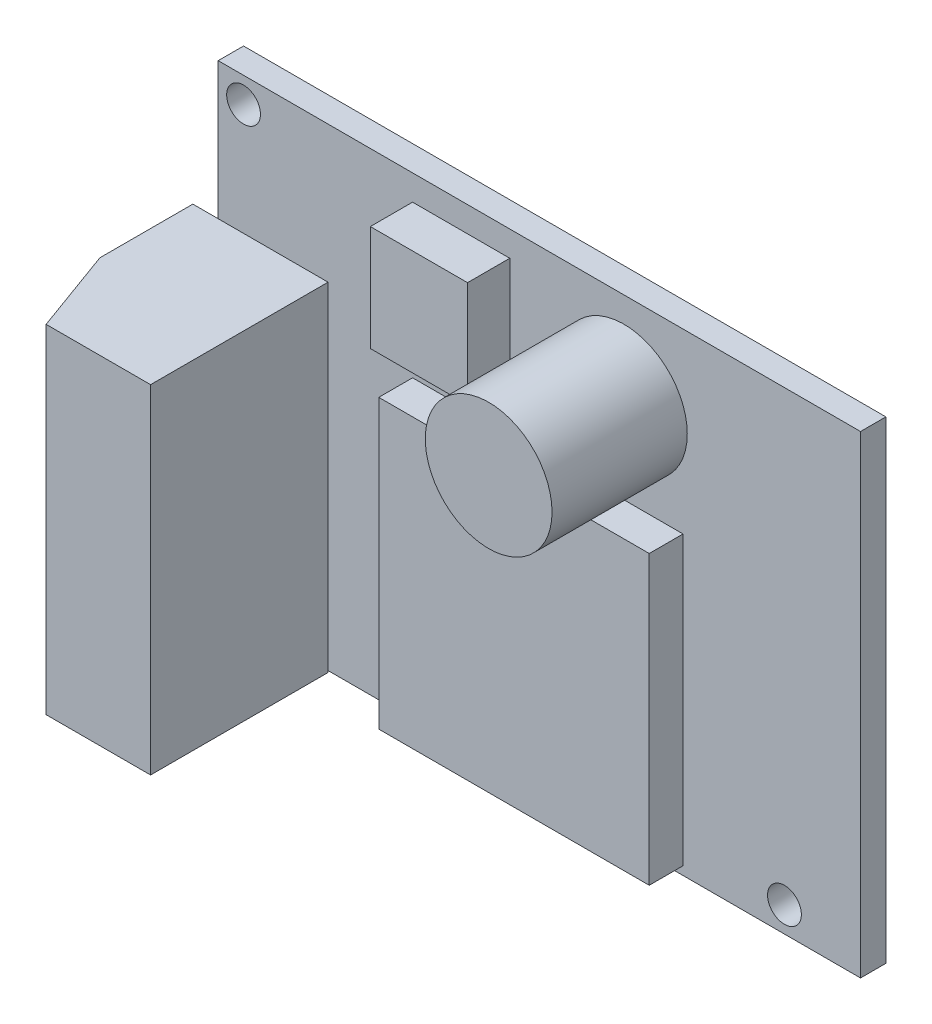
ISO-10303-21;
HEADER;
FILE_DESCRIPTION(('STEP AP214'),'2;1');
FILE_NAME('part.step','',(''),(''),'','','');
FILE_SCHEMA(('AUTOMOTIVE_DESIGN { 1 0 10303 214 1 1 1 1 }'));
ENDSEC;
DATA;
#1=APPLICATION_CONTEXT('core data for automotive mechanical design processes');
#2=APPLICATION_PROTOCOL_DEFINITION('international standard','automotive_design',2000,#1);
#3=PRODUCT_CONTEXT('',#1,'mechanical');
#4=PRODUCT('Part','Part','',(#3));
#5=PRODUCT_RELATED_PRODUCT_CATEGORY('part','',(#4));
#6=PRODUCT_DEFINITION_FORMATION('','',#4);
#7=PRODUCT_DEFINITION_CONTEXT('part definition',#1,'design');
#8=PRODUCT_DEFINITION('design','',#6,#7);
#9=PRODUCT_DEFINITION_SHAPE('','',#8);
#10=(LENGTH_UNIT() NAMED_UNIT(*) SI_UNIT(.MILLI.,.METRE.));
#11=(NAMED_UNIT(*) PLANE_ANGLE_UNIT() SI_UNIT($,.RADIAN.));
#12=(NAMED_UNIT(*) SI_UNIT($,.STERADIAN.) SOLID_ANGLE_UNIT());
#13=UNCERTAINTY_MEASURE_WITH_UNIT(LENGTH_MEASURE(1.E-05),#10,'distance_accuracy_value','');
#14=(GEOMETRIC_REPRESENTATION_CONTEXT(3) GLOBAL_UNCERTAINTY_ASSIGNED_CONTEXT((#13)) GLOBAL_UNIT_ASSIGNED_CONTEXT((#10,
#11,#12)) REPRESENTATION_CONTEXT('',''));
#15=CARTESIAN_POINT('',(0.,0.,0.));
#16=DIRECTION('',(0.,0.,1.));
#17=DIRECTION('',(1.,0.,0.));
#18=AXIS2_PLACEMENT_3D('',#15,#16,#17);
#19=CARTESIAN_POINT('',(0.,0.,1.5));
#20=DIRECTION('',(0.,0.,1.));
#21=DIRECTION('',(1.,0.,0.));
#22=AXIS2_PLACEMENT_3D('',#19,#20,#21);
#23=PLANE('',#22);
#24=DIRECTION('',(0.,1.,0.));
#25=VECTOR('',#24,1.);
#26=CARTESIAN_POINT('',(8.5,3.50000000000001,1.5));
#27=LINE('',#26,#25);
#28=CARTESIAN_POINT('',(8.5,-13.5,1.5));
#29=VERTEX_POINT('',#28);
#30=CARTESIAN_POINT('',(8.5,3.50000000000001,1.5));
#31=VERTEX_POINT('',#30);
#32=EDGE_CURVE('E216',#29,#31,#27,.T.);
#33=ORIENTED_EDGE('',*,*,#32,.F.);
#34=DIRECTION('',(1.,0.,0.));
#35=VECTOR('',#34,1.);
#36=CARTESIAN_POINT('',(8.5,-13.5,1.5));
#37=LINE('',#36,#35);
#38=CARTESIAN_POINT('',(-7.5,-13.5,1.5));
#39=VERTEX_POINT('',#38);
#40=EDGE_CURVE('E213',#39,#29,#37,.T.);
#41=ORIENTED_EDGE('',*,*,#40,.F.);
#42=DIRECTION('',(0.,-1.,0.));
#43=VECTOR('',#42,1.);
#44=CARTESIAN_POINT('',(-7.5,-13.5,1.5));
#45=LINE('',#44,#43);
#46=CARTESIAN_POINT('',(-7.5,3.50000000000001,1.5));
#47=VERTEX_POINT('',#46);
#48=EDGE_CURVE('E206',#47,#39,#45,.T.);
#49=ORIENTED_EDGE('',*,*,#48,.F.);
#50=DIRECTION('',(-1.,0.,0.));
#51=VECTOR('',#50,1.);
#52=CARTESIAN_POINT('',(-7.5,3.50000000000001,1.5));
#53=LINE('',#52,#51);
#54=EDGE_CURVE('E218',#31,#47,#53,.T.);
#55=ORIENTED_EDGE('',*,*,#54,.F.);
#56=EDGE_LOOP('',(#33,#41,#49,#55));
#57=FACE_BOUND('',#56,.T.);
#58=CARTESIAN_POINT('',(5.,8.75,1.5));
#59=DIRECTION('',(0.,0.,1.));
#60=DIRECTION('',(1.,0.,0.));
#61=AXIS2_PLACEMENT_3D('',#58,#59,#60);
#62=CIRCLE('',#61,3.75);
#63=CARTESIAN_POINT('',(8.75,8.75,1.5));
#64=VERTEX_POINT('',#63);
#65=EDGE_CURVE('E260',#64,#64,#62,.T.);
#66=ORIENTED_EDGE('',*,*,#65,.F.);
#67=EDGE_LOOP('',(#66));
#68=FACE_BOUND('',#67,.T.);
#69=DIRECTION('',(1.,0.,0.));
#70=VECTOR('',#69,1.);
#71=CARTESIAN_POINT('',(-1.75,6.25,1.5));
#72=LINE('',#71,#70);
#73=CARTESIAN_POINT('',(-7.5,6.25,1.5));
#74=VERTEX_POINT('',#73);
#75=CARTESIAN_POINT('',(-1.75,6.25,1.5));
#76=VERTEX_POINT('',#75);
#77=EDGE_CURVE('E245',#74,#76,#72,.T.);
#78=ORIENTED_EDGE('',*,*,#77,.F.);
#79=DIRECTION('',(0.,-1.,0.));
#80=VECTOR('',#79,1.);
#81=CARTESIAN_POINT('',(-7.5,12.5,1.5));
#82=LINE('',#81,#80);
#83=CARTESIAN_POINT('',(-7.5,12.5,1.5));
#84=VERTEX_POINT('',#83);
#85=EDGE_CURVE('E231',#84,#74,#82,.T.);
#86=ORIENTED_EDGE('',*,*,#85,.F.);
#87=DIRECTION('',(-1.,0.,0.));
#88=VECTOR('',#87,1.);
#89=CARTESIAN_POINT('',(-7.5,12.5,1.5));
#90=LINE('',#89,#88);
#91=CARTESIAN_POINT('',(-1.75,12.5,1.5));
#92=VERTEX_POINT('',#91);
#93=EDGE_CURVE('E236',#92,#84,#90,.T.);
#94=ORIENTED_EDGE('',*,*,#93,.F.);
#95=DIRECTION('',(0.,1.,0.));
#96=VECTOR('',#95,1.);
#97=CARTESIAN_POINT('',(-1.75,12.5,1.5));
#98=LINE('',#97,#96);
#99=EDGE_CURVE('E247',#76,#92,#98,.T.);
#100=ORIENTED_EDGE('',*,*,#99,.F.);
#101=EDGE_LOOP('',(#78,#86,#94,#100));
#102=FACE_BOUND('',#101,.T.);
#103=CARTESIAN_POINT('',(14.5,-12.5,1.5));
#104=DIRECTION('',(0.,0.,1.));
#105=DIRECTION('',(1.,0.,0.));
#106=AXIS2_PLACEMENT_3D('',#103,#104,#105);
#107=CIRCLE('',#106,1.);
#108=CARTESIAN_POINT('',(15.5,-12.5,1.5));
#109=VERTEX_POINT('',#108);
#110=EDGE_CURVE('E198',#109,#109,#107,.T.);
#111=ORIENTED_EDGE('',*,*,#110,.F.);
#112=EDGE_LOOP('',(#111));
#113=FACE_BOUND('',#112,.T.);
#114=CARTESIAN_POINT('',(-17.5,12.5,1.5));
#115=DIRECTION('',(0.,0.,1.));
#116=DIRECTION('',(1.,0.,0.));
#117=AXIS2_PLACEMENT_3D('',#114,#115,#116);
#118=CIRCLE('',#117,1.);
#119=CARTESIAN_POINT('',(-16.5,12.5,1.5));
#120=VERTEX_POINT('',#119);
#121=EDGE_CURVE('E189',#120,#120,#118,.T.);
#122=ORIENTED_EDGE('',*,*,#121,.F.);
#123=EDGE_LOOP('',(#122));
#124=FACE_BOUND('',#123,.T.);
#125=DIRECTION('',(-1.,0.,0.));
#126=VECTOR('',#125,1.);
#127=CARTESIAN_POINT('',(-12.5,5.9,1.5));
#128=LINE('',#127,#126);
#129=CARTESIAN_POINT('',(-12.5,5.9,1.5));
#130=VERTEX_POINT('',#129);
#131=CARTESIAN_POINT('',(-19.,5.90000000000001,1.5));
#132=VERTEX_POINT('',#131);
#133=EDGE_CURVE('E313',#130,#132,#128,.T.);
#134=ORIENTED_EDGE('',*,*,#133,.F.);
#135=DIRECTION('',(0.,1.,0.));
#136=VECTOR('',#135,1.);
#137=CARTESIAN_POINT('',(-12.5,5.9,1.5));
#138=LINE('',#137,#136);
#139=CARTESIAN_POINT('',(-12.5,-14.,1.5));
#140=VERTEX_POINT('',#139);
#141=EDGE_CURVE('E185',#140,#130,#138,.T.);
#142=ORIENTED_EDGE('',*,*,#141,.F.);
#143=DIRECTION('',(1.,0.,0.));
#144=VECTOR('',#143,1.);
#145=CARTESIAN_POINT('',(-19.,-14.,1.5));
#146=LINE('',#145,#144);
#147=CARTESIAN_POINT('',(19.,-14.,1.5));
#148=VERTEX_POINT('',#147);
#149=EDGE_CURVE('E270',#140,#148,#146,.T.);
#150=ORIENTED_EDGE('',*,*,#149,.T.);
#151=DIRECTION('',(0.,1.,0.));
#152=VECTOR('',#151,1.);
#153=CARTESIAN_POINT('',(19.,14.,1.5));
#154=LINE('',#153,#152);
#155=CARTESIAN_POINT('',(19.,14.,1.5));
#156=VERTEX_POINT('',#155);
#157=EDGE_CURVE('E275',#148,#156,#154,.T.);
#158=ORIENTED_EDGE('',*,*,#157,.T.);
#159=DIRECTION('',(-1.,0.,0.));
#160=VECTOR('',#159,1.);
#161=CARTESIAN_POINT('',(-19.,14.,1.5));
#162=LINE('',#161,#160);
#163=CARTESIAN_POINT('',(-19.,14.,1.5));
#164=VERTEX_POINT('',#163);
#165=EDGE_CURVE('E277',#156,#164,#162,.T.);
#166=ORIENTED_EDGE('',*,*,#165,.T.);
#167=DIRECTION('',(0.,-1.,0.));
#168=VECTOR('',#167,1.);
#169=CARTESIAN_POINT('',(-19.,14.,1.5));
#170=LINE('',#169,#168);
#171=EDGE_CURVE('E267',#164,#132,#170,.T.);
#172=ORIENTED_EDGE('',*,*,#171,.T.);
#173=EDGE_LOOP('',(#134,#142,#150,#158,#166,#172));
#174=FACE_BOUND('',#173,.T.);
#175=ADVANCED_FACE('F38',(#57,#68,#102,#113,#124,#174),#23,.T.);
#176=CARTESIAN_POINT('',(-19.,14.,1.5));
#177=DIRECTION('',(1.,0.,0.));
#178=DIRECTION('',(0.,1.,0.));
#179=AXIS2_PLACEMENT_3D('',#176,#177,#178);
#180=PLANE('',#179);
#181=DIRECTION('',(0.,-1.,0.));
#182=VECTOR('',#181,1.);
#183=CARTESIAN_POINT('',(-19.,14.,0.));
#184=LINE('',#183,#182);
#185=CARTESIAN_POINT('',(-19.,14.,0.));
#186=VERTEX_POINT('',#185);
#187=CARTESIAN_POINT('',(-19.,-14.,0.));
#188=VERTEX_POINT('',#187);
#189=EDGE_CURVE('E264',#186,#188,#184,.T.);
#190=ORIENTED_EDGE('',*,*,#189,.T.);
#191=DIRECTION('',(0.,0.,-1.));
#192=VECTOR('',#191,1.);
#193=CARTESIAN_POINT('',(-19.,-14.,1.5));
#194=LINE('',#193,#192);
#195=CARTESIAN_POINT('',(-19.,-14.,1.5));
#196=VERTEX_POINT('',#195);
#197=EDGE_CURVE('E295',#196,#188,#194,.T.);
#198=ORIENTED_EDGE('',*,*,#197,.F.);
#199=DIRECTION('',(0.,1.,0.));
#200=VECTOR('',#199,1.);
#201=CARTESIAN_POINT('',(-19.,14.,1.5));
#202=LINE('',#201,#200);
#203=EDGE_CURVE('E186',#196,#132,#202,.T.);
#204=ORIENTED_EDGE('',*,*,#203,.T.);
#205=ORIENTED_EDGE('',*,*,#171,.F.);
#206=DIRECTION('',(0.,0.,-1.));
#207=VECTOR('',#206,1.);
#208=CARTESIAN_POINT('',(-19.,14.,1.5));
#209=LINE('',#208,#207);
#210=EDGE_CURVE('E279',#164,#186,#209,.T.);
#211=ORIENTED_EDGE('',*,*,#210,.T.);
#212=EDGE_LOOP('',(#190,#198,#204,#205,#211));
#213=FACE_BOUND('',#212,.T.);
#214=ADVANCED_FACE('F332',(#213),#180,.F.);
#215=CARTESIAN_POINT('',(-19.,-14.,1.5));
#216=DIRECTION('',(0.,1.,0.));
#217=DIRECTION('',(0.,0.,1.));
#218=AXIS2_PLACEMENT_3D('',#215,#216,#217);
#219=PLANE('',#218);
#220=DIRECTION('',(1.,0.,0.));
#221=VECTOR('',#220,1.);
#222=CARTESIAN_POINT('',(-19.,-14.,0.));
#223=LINE('',#222,#221);
#224=CARTESIAN_POINT('',(19.,-14.,0.));
#225=VERTEX_POINT('',#224);
#226=EDGE_CURVE('E282',#188,#225,#223,.T.);
#227=ORIENTED_EDGE('',*,*,#226,.T.);
#228=DIRECTION('',(0.,0.,-1.));
#229=VECTOR('',#228,1.);
#230=CARTESIAN_POINT('',(19.,-14.,1.5));
#231=LINE('',#230,#229);
#232=EDGE_CURVE('E292',#148,#225,#231,.T.);
#233=ORIENTED_EDGE('',*,*,#232,.F.);
#234=ORIENTED_EDGE('',*,*,#149,.F.);
#235=EDGE_CURVE('E272',#196,#140,#146,.T.);
#236=ORIENTED_EDGE('',*,*,#235,.F.);
#237=ORIENTED_EDGE('',*,*,#197,.T.);
#238=EDGE_LOOP('',(#227,#233,#234,#236,#237));
#239=FACE_BOUND('',#238,.T.);
#240=ADVANCED_FACE('F329',(#239),#219,.F.);
#241=CARTESIAN_POINT('',(19.,14.,1.5));
#242=DIRECTION('',(-1.,0.,0.));
#243=DIRECTION('',(0.,0.,1.));
#244=AXIS2_PLACEMENT_3D('',#241,#242,#243);
#245=PLANE('',#244);
#246=DIRECTION('',(0.,1.,0.));
#247=VECTOR('',#246,1.);
#248=CARTESIAN_POINT('',(19.,14.,0.));
#249=LINE('',#248,#247);
#250=CARTESIAN_POINT('',(19.,14.,0.));
#251=VERTEX_POINT('',#250);
#252=EDGE_CURVE('E284',#225,#251,#249,.T.);
#253=ORIENTED_EDGE('',*,*,#252,.T.);
#254=DIRECTION('',(0.,0.,-1.));
#255=VECTOR('',#254,1.);
#256=CARTESIAN_POINT('',(19.,14.,1.5));
#257=LINE('',#256,#255);
#258=EDGE_CURVE('E289',#156,#251,#257,.T.);
#259=ORIENTED_EDGE('',*,*,#258,.F.);
#260=ORIENTED_EDGE('',*,*,#157,.F.);
#261=ORIENTED_EDGE('',*,*,#232,.T.);
#262=EDGE_LOOP('',(#253,#259,#260,#261));
#263=FACE_BOUND('',#262,.T.);
#264=ADVANCED_FACE('F342',(#263),#245,.F.);
#265=CARTESIAN_POINT('',(-19.,14.,1.5));
#266=DIRECTION('',(0.,-1.,0.));
#267=DIRECTION('',(0.,0.,-1.));
#268=AXIS2_PLACEMENT_3D('',#265,#266,#267);
#269=PLANE('',#268);
#270=DIRECTION('',(-1.,0.,0.));
#271=VECTOR('',#270,1.);
#272=CARTESIAN_POINT('',(-19.,14.,0.));
#273=LINE('',#272,#271);
#274=EDGE_CURVE('E271',#251,#186,#273,.T.);
#275=ORIENTED_EDGE('',*,*,#274,.T.);
#276=ORIENTED_EDGE('',*,*,#210,.F.);
#277=ORIENTED_EDGE('',*,*,#165,.F.);
#278=ORIENTED_EDGE('',*,*,#258,.T.);
#279=EDGE_LOOP('',(#275,#276,#277,#278));
#280=FACE_BOUND('',#279,.T.);
#281=ADVANCED_FACE('F365',(#280),#269,.F.);
#282=CARTESIAN_POINT('',(0.,0.,0.));
#283=DIRECTION('',(0.,0.,1.));
#284=DIRECTION('',(1.,0.,0.));
#285=AXIS2_PLACEMENT_3D('',#282,#283,#284);
#286=PLANE('',#285);
#287=CARTESIAN_POINT('',(-17.5,12.5,0.));
#288=DIRECTION('',(0.,0.,1.));
#289=DIRECTION('',(1.,0.,0.));
#290=AXIS2_PLACEMENT_3D('',#287,#288,#289);
#291=CIRCLE('',#290,1.);
#292=CARTESIAN_POINT('',(-16.5,12.5,0.));
#293=VERTEX_POINT('',#292);
#294=EDGE_CURVE('E197',#293,#293,#291,.T.);
#295=ORIENTED_EDGE('',*,*,#294,.T.);
#296=EDGE_LOOP('',(#295));
#297=FACE_BOUND('',#296,.T.);
#298=CARTESIAN_POINT('',(14.5,-12.5,0.));
#299=DIRECTION('',(0.,0.,1.));
#300=DIRECTION('',(1.,0.,0.));
#301=AXIS2_PLACEMENT_3D('',#298,#299,#300);
#302=CIRCLE('',#301,1.);
#303=CARTESIAN_POINT('',(15.5,-12.5,0.));
#304=VERTEX_POINT('',#303);
#305=EDGE_CURVE('E201',#304,#304,#302,.T.);
#306=ORIENTED_EDGE('',*,*,#305,.T.);
#307=EDGE_LOOP('',(#306));
#308=FACE_BOUND('',#307,.T.);
#309=ORIENTED_EDGE('',*,*,#189,.F.);
#310=ORIENTED_EDGE('',*,*,#274,.F.);
#311=ORIENTED_EDGE('',*,*,#252,.F.);
#312=ORIENTED_EDGE('',*,*,#226,.F.);
#313=EDGE_LOOP('',(#309,#310,#311,#312));
#314=FACE_BOUND('',#313,.T.);
#315=ADVANCED_FACE('F338',(#297,#308,#314),#286,.F.);
#316=CARTESIAN_POINT('',(5.,8.75,9.5));
#317=DIRECTION('',(0.,0.,-1.));
#318=DIRECTION('',(-1.,0.,0.));
#319=AXIS2_PLACEMENT_3D('',#316,#317,#318);
#320=CYLINDRICAL_SURFACE('',#319,3.75);
#321=CARTESIAN_POINT('',(5.,8.75,9.5));
#322=DIRECTION('',(0.,0.,1.));
#323=DIRECTION('',(1.,0.,0.));
#324=AXIS2_PLACEMENT_3D('',#321,#322,#323);
#325=CIRCLE('',#324,3.75);
#326=CARTESIAN_POINT('',(8.75,8.75,9.5));
#327=VERTEX_POINT('',#326);
#328=EDGE_CURVE('E261',#327,#327,#325,.T.);
#329=ORIENTED_EDGE('',*,*,#328,.F.);
#330=EDGE_LOOP('',(#329));
#331=FACE_BOUND('',#330,.T.);
#332=ORIENTED_EDGE('',*,*,#65,.T.);
#333=EDGE_LOOP('',(#332));
#334=FACE_BOUND('',#333,.T.);
#335=ADVANCED_FACE('F361',(#331,#334),#320,.T.);
#336=CARTESIAN_POINT('',(5.,8.75,9.5));
#337=DIRECTION('',(0.,0.,1.));
#338=DIRECTION('',(1.,0.,0.));
#339=AXIS2_PLACEMENT_3D('',#336,#337,#338);
#340=PLANE('',#339);
#341=ORIENTED_EDGE('',*,*,#328,.T.);
#342=EDGE_LOOP('',(#341));
#343=FACE_BOUND('',#342,.T.);
#344=ADVANCED_FACE('F399',(#343),#340,.T.);
#345=CARTESIAN_POINT('',(-7.5,12.5,4.));
#346=DIRECTION('',(1.,0.,0.));
#347=DIRECTION('',(0.,1.,0.));
#348=AXIS2_PLACEMENT_3D('',#345,#346,#347);
#349=PLANE('',#348);
#350=ORIENTED_EDGE('',*,*,#85,.T.);
#351=DIRECTION('',(0.,0.,-1.));
#352=VECTOR('',#351,1.);
#353=CARTESIAN_POINT('',(-7.5,6.25,4.));
#354=LINE('',#353,#352);
#355=CARTESIAN_POINT('',(-7.5,6.25,4.));
#356=VERTEX_POINT('',#355);
#357=EDGE_CURVE('E258',#356,#74,#354,.T.);
#358=ORIENTED_EDGE('',*,*,#357,.F.);
#359=DIRECTION('',(0.,-1.,0.));
#360=VECTOR('',#359,1.);
#361=CARTESIAN_POINT('',(-7.5,12.5,4.));
#362=LINE('',#361,#360);
#363=CARTESIAN_POINT('',(-7.5,12.5,4.));
#364=VERTEX_POINT('',#363);
#365=EDGE_CURVE('E232',#364,#356,#362,.T.);
#366=ORIENTED_EDGE('',*,*,#365,.F.);
#367=DIRECTION('',(0.,0.,-1.));
#368=VECTOR('',#367,1.);
#369=CARTESIAN_POINT('',(-7.5,12.5,4.));
#370=LINE('',#369,#368);
#371=EDGE_CURVE('E242',#364,#84,#370,.T.);
#372=ORIENTED_EDGE('',*,*,#371,.T.);
#373=EDGE_LOOP('',(#350,#358,#366,#372));
#374=FACE_BOUND('',#373,.T.);
#375=ADVANCED_FACE('F406',(#374),#349,.F.);
#376=CARTESIAN_POINT('',(-1.75,6.25,4.));
#377=DIRECTION('',(0.,1.,0.));
#378=DIRECTION('',(0.,0.,1.));
#379=AXIS2_PLACEMENT_3D('',#376,#377,#378);
#380=PLANE('',#379);
#381=ORIENTED_EDGE('',*,*,#77,.T.);
#382=DIRECTION('',(0.,0.,-1.));
#383=VECTOR('',#382,1.);
#384=CARTESIAN_POINT('',(-1.75,6.25,4.));
#385=LINE('',#384,#383);
#386=CARTESIAN_POINT('',(-1.75,6.25,4.));
#387=VERTEX_POINT('',#386);
#388=EDGE_CURVE('E255',#387,#76,#385,.T.);
#389=ORIENTED_EDGE('',*,*,#388,.F.);
#390=DIRECTION('',(1.,0.,0.));
#391=VECTOR('',#390,1.);
#392=CARTESIAN_POINT('',(-1.75,6.25,4.));
#393=LINE('',#392,#391);
#394=EDGE_CURVE('E235',#356,#387,#393,.T.);
#395=ORIENTED_EDGE('',*,*,#394,.F.);
#396=ORIENTED_EDGE('',*,*,#357,.T.);
#397=EDGE_LOOP('',(#381,#389,#395,#396));
#398=FACE_BOUND('',#397,.T.);
#399=ADVANCED_FACE('F414',(#398),#380,.F.);
#400=CARTESIAN_POINT('',(-1.75,12.5,4.));
#401=DIRECTION('',(-1.,0.,0.));
#402=DIRECTION('',(0.,0.,1.));
#403=AXIS2_PLACEMENT_3D('',#400,#401,#402);
#404=PLANE('',#403);
#405=ORIENTED_EDGE('',*,*,#99,.T.);
#406=DIRECTION('',(0.,0.,-1.));
#407=VECTOR('',#406,1.);
#408=CARTESIAN_POINT('',(-1.75,12.5,4.));
#409=LINE('',#408,#407);
#410=CARTESIAN_POINT('',(-1.75,12.5,4.));
#411=VERTEX_POINT('',#410);
#412=EDGE_CURVE('E253',#411,#92,#409,.T.);
#413=ORIENTED_EDGE('',*,*,#412,.F.);
#414=DIRECTION('',(0.,1.,0.));
#415=VECTOR('',#414,1.);
#416=CARTESIAN_POINT('',(-1.75,12.5,4.));
#417=LINE('',#416,#415);
#418=EDGE_CURVE('E238',#387,#411,#417,.T.);
#419=ORIENTED_EDGE('',*,*,#418,.F.);
#420=ORIENTED_EDGE('',*,*,#388,.T.);
#421=EDGE_LOOP('',(#405,#413,#419,#420));
#422=FACE_BOUND('',#421,.T.);
#423=ADVANCED_FACE('F423',(#422),#404,.F.);
#424=CARTESIAN_POINT('',(-7.5,12.5,4.));
#425=DIRECTION('',(0.,-1.,0.));
#426=DIRECTION('',(0.,0.,-1.));
#427=AXIS2_PLACEMENT_3D('',#424,#425,#426);
#428=PLANE('',#427);
#429=ORIENTED_EDGE('',*,*,#93,.T.);
#430=ORIENTED_EDGE('',*,*,#371,.F.);
#431=DIRECTION('',(-1.,0.,0.));
#432=VECTOR('',#431,1.);
#433=CARTESIAN_POINT('',(-7.5,12.5,4.));
#434=LINE('',#433,#432);
#435=EDGE_CURVE('E240',#411,#364,#434,.T.);
#436=ORIENTED_EDGE('',*,*,#435,.F.);
#437=ORIENTED_EDGE('',*,*,#412,.T.);
#438=EDGE_LOOP('',(#429,#430,#436,#437));
#439=FACE_BOUND('',#438,.T.);
#440=ADVANCED_FACE('F431',(#439),#428,.F.);
#441=CARTESIAN_POINT('',(0.,0.,4.));
#442=DIRECTION('',(0.,0.,-1.));
#443=DIRECTION('',(-1.,0.,0.));
#444=AXIS2_PLACEMENT_3D('',#441,#442,#443);
#445=PLANE('',#444);
#446=ORIENTED_EDGE('',*,*,#365,.T.);
#447=ORIENTED_EDGE('',*,*,#394,.T.);
#448=ORIENTED_EDGE('',*,*,#418,.T.);
#449=ORIENTED_EDGE('',*,*,#435,.T.);
#450=EDGE_LOOP('',(#446,#447,#448,#449));
#451=FACE_BOUND('',#450,.T.);
#452=ADVANCED_FACE('F438',(#451),#445,.F.);
#453=CARTESIAN_POINT('',(8.5,-13.5,3.5));
#454=DIRECTION('',(0.,1.,0.));
#455=DIRECTION('',(0.,0.,1.));
#456=AXIS2_PLACEMENT_3D('',#453,#454,#455);
#457=PLANE('',#456);
#458=ORIENTED_EDGE('',*,*,#40,.T.);
#459=DIRECTION('',(0.,0.,-1.));
#460=VECTOR('',#459,1.);
#461=CARTESIAN_POINT('',(8.5,-13.5,3.5));
#462=LINE('',#461,#460);
#463=CARTESIAN_POINT('',(8.5,-13.5,3.5));
#464=VERTEX_POINT('',#463);
#465=EDGE_CURVE('E229',#464,#29,#462,.T.);
#466=ORIENTED_EDGE('',*,*,#465,.F.);
#467=DIRECTION('',(1.,0.,0.));
#468=VECTOR('',#467,1.);
#469=CARTESIAN_POINT('',(8.5,-13.5,3.5));
#470=LINE('',#469,#468);
#471=CARTESIAN_POINT('',(-7.5,-13.5,3.5));
#472=VERTEX_POINT('',#471);
#473=EDGE_CURVE('E202',#472,#464,#470,.T.);
#474=ORIENTED_EDGE('',*,*,#473,.F.);
#475=DIRECTION('',(0.,0.,-1.));
#476=VECTOR('',#475,1.);
#477=CARTESIAN_POINT('',(-7.5,-13.5,3.5));
#478=LINE('',#477,#476);
#479=EDGE_CURVE('E212',#472,#39,#478,.T.);
#480=ORIENTED_EDGE('',*,*,#479,.T.);
#481=EDGE_LOOP('',(#458,#466,#474,#480));
#482=FACE_BOUND('',#481,.T.);
#483=ADVANCED_FACE('F445',(#482),#457,.F.);
#484=CARTESIAN_POINT('',(8.5,3.50000000000001,3.5));
#485=DIRECTION('',(-1.,0.,0.));
#486=DIRECTION('',(0.,0.,1.));
#487=AXIS2_PLACEMENT_3D('',#484,#485,#486);
#488=PLANE('',#487);
#489=ORIENTED_EDGE('',*,*,#32,.T.);
#490=DIRECTION('',(0.,0.,-1.));
#491=VECTOR('',#490,1.);
#492=CARTESIAN_POINT('',(8.5,3.50000000000001,3.5));
#493=LINE('',#492,#491);
#494=CARTESIAN_POINT('',(8.5,3.50000000000001,3.5));
#495=VERTEX_POINT('',#494);
#496=EDGE_CURVE('E226',#495,#31,#493,.T.);
#497=ORIENTED_EDGE('',*,*,#496,.F.);
#498=DIRECTION('',(0.,1.,0.));
#499=VECTOR('',#498,1.);
#500=CARTESIAN_POINT('',(8.5,3.50000000000001,3.5));
#501=LINE('',#500,#499);
#502=EDGE_CURVE('E205',#464,#495,#501,.T.);
#503=ORIENTED_EDGE('',*,*,#502,.F.);
#504=ORIENTED_EDGE('',*,*,#465,.T.);
#505=EDGE_LOOP('',(#489,#497,#503,#504));
#506=FACE_BOUND('',#505,.T.);
#507=ADVANCED_FACE('F453',(#506),#488,.F.);
#508=CARTESIAN_POINT('',(-7.5,3.50000000000001,3.5));
#509=DIRECTION('',(0.,-1.,0.));
#510=DIRECTION('',(0.,0.,-1.));
#511=AXIS2_PLACEMENT_3D('',#508,#509,#510);
#512=PLANE('',#511);
#513=ORIENTED_EDGE('',*,*,#54,.T.);
#514=DIRECTION('',(0.,0.,-1.));
#515=VECTOR('',#514,1.);
#516=CARTESIAN_POINT('',(-7.5,3.50000000000001,3.5));
#517=LINE('',#516,#515);
#518=CARTESIAN_POINT('',(-7.5,3.50000000000001,3.5));
#519=VERTEX_POINT('',#518);
#520=EDGE_CURVE('E224',#519,#47,#517,.T.);
#521=ORIENTED_EDGE('',*,*,#520,.F.);
#522=DIRECTION('',(-1.,0.,0.));
#523=VECTOR('',#522,1.);
#524=CARTESIAN_POINT('',(-7.5,3.50000000000001,3.5));
#525=LINE('',#524,#523);
#526=EDGE_CURVE('E208',#495,#519,#525,.T.);
#527=ORIENTED_EDGE('',*,*,#526,.F.);
#528=ORIENTED_EDGE('',*,*,#496,.T.);
#529=EDGE_LOOP('',(#513,#521,#527,#528));
#530=FACE_BOUND('',#529,.T.);
#531=ADVANCED_FACE('F462',(#530),#512,.F.);
#532=CARTESIAN_POINT('',(-7.5,-13.5,3.5));
#533=DIRECTION('',(1.,0.,0.));
#534=DIRECTION('',(0.,0.,-1.));
#535=AXIS2_PLACEMENT_3D('',#532,#533,#534);
#536=PLANE('',#535);
#537=ORIENTED_EDGE('',*,*,#48,.T.);
#538=ORIENTED_EDGE('',*,*,#479,.F.);
#539=DIRECTION('',(0.,-1.,0.));
#540=VECTOR('',#539,1.);
#541=CARTESIAN_POINT('',(-7.5,-13.5,3.5));
#542=LINE('',#541,#540);
#543=EDGE_CURVE('E210',#519,#472,#542,.T.);
#544=ORIENTED_EDGE('',*,*,#543,.F.);
#545=ORIENTED_EDGE('',*,*,#520,.T.);
#546=EDGE_LOOP('',(#537,#538,#544,#545));
#547=FACE_BOUND('',#546,.T.);
#548=ADVANCED_FACE('F471',(#547),#536,.F.);
#549=CARTESIAN_POINT('',(0.,0.,3.5));
#550=DIRECTION('',(0.,0.,-1.));
#551=DIRECTION('',(-1.,0.,0.));
#552=AXIS2_PLACEMENT_3D('',#549,#550,#551);
#553=PLANE('',#552);
#554=ORIENTED_EDGE('',*,*,#473,.T.);
#555=ORIENTED_EDGE('',*,*,#502,.T.);
#556=ORIENTED_EDGE('',*,*,#526,.T.);
#557=ORIENTED_EDGE('',*,*,#543,.T.);
#558=EDGE_LOOP('',(#554,#555,#556,#557));
#559=FACE_BOUND('',#558,.T.);
#560=ADVANCED_FACE('F478',(#559),#553,.F.);
#561=CARTESIAN_POINT('',(14.5,-12.5,-0.5));
#562=DIRECTION('',(0.,0.,1.));
#563=DIRECTION('',(1.,0.,0.));
#564=AXIS2_PLACEMENT_3D('',#561,#562,#563);
#565=CYLINDRICAL_SURFACE('',#564,1.);
#566=ORIENTED_EDGE('',*,*,#110,.T.);
#567=EDGE_LOOP('',(#566));
#568=FACE_BOUND('',#567,.T.);
#569=ORIENTED_EDGE('',*,*,#305,.F.);
#570=EDGE_LOOP('',(#569));
#571=FACE_BOUND('',#570,.T.);
#572=ADVANCED_FACE('F485',(#568,#571),#565,.F.);
#573=CARTESIAN_POINT('',(-17.5,12.5,-0.5));
#574=DIRECTION('',(0.,0.,1.));
#575=DIRECTION('',(1.,0.,0.));
#576=AXIS2_PLACEMENT_3D('',#573,#574,#575);
#577=CYLINDRICAL_SURFACE('',#576,1.);
#578=ORIENTED_EDGE('',*,*,#121,.T.);
#579=EDGE_LOOP('',(#578));
#580=FACE_BOUND('',#579,.T.);
#581=ORIENTED_EDGE('',*,*,#294,.F.);
#582=EDGE_LOOP('',(#581));
#583=FACE_BOUND('',#582,.T.);
#584=ADVANCED_FACE('F493',(#580,#583),#577,.F.);
#585=CARTESIAN_POINT('',(0.,0.,1.5));
#586=DIRECTION('',(0.,0.,-1.));
#587=DIRECTION('',(-1.,0.,0.));
#588=AXIS2_PLACEMENT_3D('',#585,#586,#587);
#589=PLANE('',#588);
#590=ORIENTED_EDGE('',*,*,#203,.F.);
#591=ORIENTED_EDGE('',*,*,#235,.T.);
#592=CARTESIAN_POINT('',(-12.5,-14.1,1.5));
#593=VERTEX_POINT('',#592);
#594=EDGE_CURVE('E310',#593,#140,#138,.T.);
#595=ORIENTED_EDGE('',*,*,#594,.F.);
#596=DIRECTION('',(1.,0.,0.));
#597=VECTOR('',#596,1.);
#598=CARTESIAN_POINT('',(-12.5,-14.1,1.5));
#599=LINE('',#598,#597);
#600=CARTESIAN_POINT('',(-20.5,-14.1,1.5));
#601=VERTEX_POINT('',#600);
#602=EDGE_CURVE('E179',#601,#593,#599,.T.);
#603=ORIENTED_EDGE('',*,*,#602,.F.);
#604=DIRECTION('',(0.,-1.,0.));
#605=VECTOR('',#604,1.);
#606=CARTESIAN_POINT('',(-20.5,5.9,1.5));
#607=LINE('',#606,#605);
#608=CARTESIAN_POINT('',(-20.5,5.9,1.5));
#609=VERTEX_POINT('',#608);
#610=EDGE_CURVE('E315',#609,#601,#607,.T.);
#611=ORIENTED_EDGE('',*,*,#610,.F.);
#612=EDGE_CURVE('E312',#132,#609,#128,.T.);
#613=ORIENTED_EDGE('',*,*,#612,.F.);
#614=EDGE_LOOP('',(#590,#591,#595,#603,#611,#613));
#615=FACE_BOUND('',#614,.T.);
#616=ADVANCED_FACE('F326',(#615),#589,.T.);
#617=CARTESIAN_POINT('',(-12.5,5.9,12.));
#618=DIRECTION('',(-1.,0.,0.));
#619=DIRECTION('',(0.,-1.,0.));
#620=AXIS2_PLACEMENT_3D('',#617,#618,#619);
#621=PLANE('',#620);
#622=ORIENTED_EDGE('',*,*,#594,.T.);
#623=ORIENTED_EDGE('',*,*,#141,.T.);
#624=DIRECTION('',(0.,0.,-1.));
#625=VECTOR('',#624,1.);
#626=CARTESIAN_POINT('',(-12.5,5.9,12.));
#627=LINE('',#626,#625);
#628=CARTESIAN_POINT('',(-12.5,5.9,12.));
#629=VERTEX_POINT('',#628);
#630=EDGE_CURVE('E166',#629,#130,#627,.T.);
#631=ORIENTED_EDGE('',*,*,#630,.F.);
#632=DIRECTION('',(0.,1.,0.));
#633=VECTOR('',#632,1.);
#634=CARTESIAN_POINT('',(-12.5,5.9,12.));
#635=LINE('',#634,#633);
#636=CARTESIAN_POINT('',(-12.5,-14.1,12.));
#637=VERTEX_POINT('',#636);
#638=EDGE_CURVE('E172',#637,#629,#635,.T.);
#639=ORIENTED_EDGE('',*,*,#638,.F.);
#640=DIRECTION('',(0.,0.,-1.));
#641=VECTOR('',#640,1.);
#642=CARTESIAN_POINT('',(-12.5,-14.1,12.));
#643=LINE('',#642,#641);
#644=EDGE_CURVE('E306',#637,#593,#643,.T.);
#645=ORIENTED_EDGE('',*,*,#644,.T.);
#646=EDGE_LOOP('',(#622,#623,#631,#639,#645));
#647=FACE_BOUND('',#646,.T.);
#648=ADVANCED_FACE('F183',(#647),#621,.F.);
#649=CARTESIAN_POINT('',(-12.5,5.9,12.));
#650=DIRECTION('',(0.,-1.,0.));
#651=DIRECTION('',(1.,0.,0.));
#652=AXIS2_PLACEMENT_3D('',#649,#650,#651);
#653=PLANE('',#652);
#654=DIRECTION('',(0.,0.,-1.));
#655=VECTOR('',#654,1.);
#656=CARTESIAN_POINT('',(-20.5,5.9,12.));
#657=LINE('',#656,#655);
#658=CARTESIAN_POINT('',(-20.5,5.9,6.99999999999995));
#659=VERTEX_POINT('',#658);
#660=EDGE_CURVE('E187',#659,#609,#657,.T.);
#661=ORIENTED_EDGE('',*,*,#660,.F.);
#662=DIRECTION('',(-0.342020143325666,0.,-0.93969262078591));
#663=VECTOR('',#662,1.);
#664=CARTESIAN_POINT('',(-18.680148828669,5.9,12.));
#665=LINE('',#664,#663);
#666=CARTESIAN_POINT('',(-18.680148828669,5.9,12.));
#667=VERTEX_POINT('',#666);
#668=EDGE_CURVE('E11',#659,#667,#665,.F.);
#669=ORIENTED_EDGE('',*,*,#668,.T.);
#670=DIRECTION('',(-1.,0.,0.));
#671=VECTOR('',#670,1.);
#672=CARTESIAN_POINT('',(-12.5,5.9,12.));
#673=LINE('',#672,#671);
#674=EDGE_CURVE('E161',#629,#667,#673,.T.);
#675=ORIENTED_EDGE('',*,*,#674,.F.);
#676=ORIENTED_EDGE('',*,*,#630,.T.);
#677=ORIENTED_EDGE('',*,*,#133,.T.);
#678=ORIENTED_EDGE('',*,*,#612,.T.);
#679=EDGE_LOOP('',(#661,#669,#675,#676,#677,#678));
#680=FACE_BOUND('',#679,.T.);
#681=ADVANCED_FACE('F163',(#680),#653,.F.);
#682=CARTESIAN_POINT('',(-20.5,5.9,12.));
#683=DIRECTION('',(1.,0.,0.));
#684=DIRECTION('',(0.,1.,0.));
#685=AXIS2_PLACEMENT_3D('',#682,#683,#684);
#686=PLANE('',#685);
#687=DIRECTION('',(0.,0.,-1.));
#688=VECTOR('',#687,1.);
#689=CARTESIAN_POINT('',(-20.5,-14.1,12.));
#690=LINE('',#689,#688);
#691=CARTESIAN_POINT('',(-20.5,-14.1,6.99999999999996));
#692=VERTEX_POINT('',#691);
#693=EDGE_CURVE('E191',#692,#601,#690,.T.);
#694=ORIENTED_EDGE('',*,*,#693,.F.);
#695=DIRECTION('',(0.,1.,0.));
#696=VECTOR('',#695,1.);
#697=CARTESIAN_POINT('',(-20.5,5.9,6.99999999999995));
#698=LINE('',#697,#696);
#699=EDGE_CURVE('E46',#692,#659,#698,.T.);
#700=ORIENTED_EDGE('',*,*,#699,.T.);
#701=ORIENTED_EDGE('',*,*,#660,.T.);
#702=ORIENTED_EDGE('',*,*,#610,.T.);
#703=EDGE_LOOP('',(#694,#700,#701,#702));
#704=FACE_BOUND('',#703,.T.);
#705=ADVANCED_FACE('F320',(#704),#686,.F.);
#706=CARTESIAN_POINT('',(-12.5,-14.1,12.));
#707=DIRECTION('',(0.,1.,0.));
#708=DIRECTION('',(-1.,0.,0.));
#709=AXIS2_PLACEMENT_3D('',#706,#707,#708);
#710=PLANE('',#709);
#711=DIRECTION('',(1.,0.,0.));
#712=VECTOR('',#711,1.);
#713=CARTESIAN_POINT('',(-12.5,-14.1,12.));
#714=LINE('',#713,#712);
#715=CARTESIAN_POINT('',(-18.680148828669,-14.1,12.));
#716=VERTEX_POINT('',#715);
#717=EDGE_CURVE('E171',#716,#637,#714,.T.);
#718=ORIENTED_EDGE('',*,*,#717,.F.);
#719=DIRECTION('',(0.342020143325666,0.,0.93969262078591));
#720=VECTOR('',#719,1.);
#721=CARTESIAN_POINT('',(-18.680148828669,-14.1,12.));
#722=LINE('',#721,#720);
#723=EDGE_CURVE('E60',#716,#692,#722,.F.);
#724=ORIENTED_EDGE('',*,*,#723,.T.);
#725=ORIENTED_EDGE('',*,*,#693,.T.);
#726=ORIENTED_EDGE('',*,*,#602,.T.);
#727=ORIENTED_EDGE('',*,*,#644,.F.);
#728=EDGE_LOOP('',(#718,#724,#725,#726,#727));
#729=FACE_BOUND('',#728,.T.);
#730=ADVANCED_FACE('F305',(#729),#710,.F.);
#731=CARTESIAN_POINT('',(0.,0.,12.));
#732=DIRECTION('',(0.,0.,-1.));
#733=DIRECTION('',(-1.,0.,0.));
#734=AXIS2_PLACEMENT_3D('',#731,#732,#733);
#735=PLANE('',#734);
#736=ORIENTED_EDGE('',*,*,#674,.T.);
#737=DIRECTION('',(0.,-1.,0.));
#738=VECTOR('',#737,1.);
#739=CARTESIAN_POINT('',(-18.680148828669,0.,12.));
#740=LINE('',#739,#738);
#741=EDGE_CURVE('E298',#667,#716,#740,.T.);
#742=ORIENTED_EDGE('',*,*,#741,.T.);
#743=ORIENTED_EDGE('',*,*,#717,.T.);
#744=ORIENTED_EDGE('',*,*,#638,.T.);
#745=EDGE_LOOP('',(#736,#742,#743,#744));
#746=FACE_BOUND('',#745,.T.);
#747=ADVANCED_FACE('F175',(#746),#735,.F.);
#748=CARTESIAN_POINT('',(-18.680148828669,0.,12.));
#749=DIRECTION('',(0.939692620785909,0.,-0.342020143325666));
#750=DIRECTION('',(0.,-1.,0.));
#751=AXIS2_PLACEMENT_3D('',#748,#749,#750);
#752=PLANE('',#751);
#753=ORIENTED_EDGE('',*,*,#668,.F.);
#754=ORIENTED_EDGE('',*,*,#699,.F.);
#755=ORIENTED_EDGE('',*,*,#723,.F.);
#756=ORIENTED_EDGE('',*,*,#741,.F.);
#757=EDGE_LOOP('',(#753,#754,#755,#756));
#758=FACE_BOUND('',#757,.T.);
#759=ADVANCED_FACE('F40',(#758),#752,.F.);
#760=CLOSED_SHELL('',(#175,#214,#240,#264,#281,#315,#335,#344,#375,#399,#423,#440,#452,#483,
#507,#531,#548,#560,#572,#584,#616,#648,#681,#705,#730,#747,#759));
#761=MANIFOLD_SOLID_BREP('B2',#760);
#762=ADVANCED_BREP_SHAPE_REPRESENTATION('',(#18,#761),#14);
#763=SHAPE_DEFINITION_REPRESENTATION(#9,#762);
ENDSEC;
END-ISO-10303-21;
